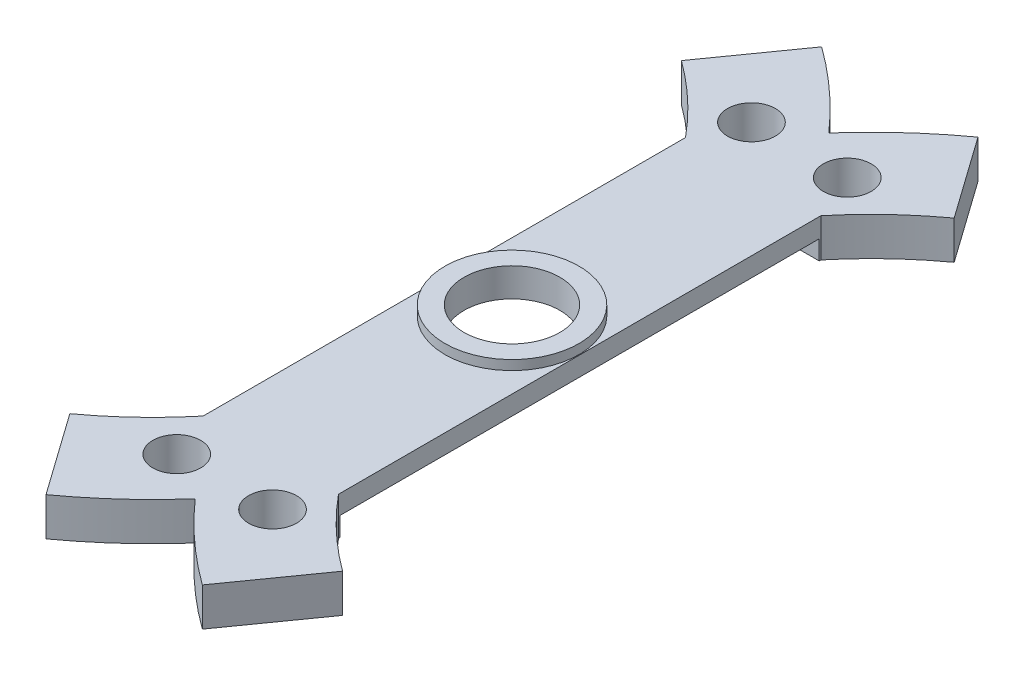
ISO-10303-21;
HEADER;
FILE_DESCRIPTION(('STEP AP214'),'2;1');
FILE_NAME('part.step','',(''),(''),'','','');
FILE_SCHEMA(('AUTOMOTIVE_DESIGN { 1 0 10303 214 1 1 1 1 }'));
ENDSEC;
DATA;
#1=APPLICATION_CONTEXT('core data for automotive mechanical design processes');
#2=APPLICATION_PROTOCOL_DEFINITION('international standard','automotive_design',2000,#1);
#3=PRODUCT_CONTEXT('',#1,'mechanical');
#4=PRODUCT('Part','Part','',(#3));
#5=PRODUCT_RELATED_PRODUCT_CATEGORY('part','',(#4));
#6=PRODUCT_DEFINITION_FORMATION('','',#4);
#7=PRODUCT_DEFINITION_CONTEXT('part definition',#1,'design');
#8=PRODUCT_DEFINITION('design','',#6,#7);
#9=PRODUCT_DEFINITION_SHAPE('','',#8);
#10=(LENGTH_UNIT() NAMED_UNIT(*) SI_UNIT(.MILLI.,.METRE.));
#11=(NAMED_UNIT(*) PLANE_ANGLE_UNIT() SI_UNIT($,.RADIAN.));
#12=(NAMED_UNIT(*) SI_UNIT($,.STERADIAN.) SOLID_ANGLE_UNIT());
#13=UNCERTAINTY_MEASURE_WITH_UNIT(LENGTH_MEASURE(1.E-05),#10,'distance_accuracy_value','');
#14=(GEOMETRIC_REPRESENTATION_CONTEXT(3) GLOBAL_UNCERTAINTY_ASSIGNED_CONTEXT((#13)) GLOBAL_UNIT_ASSIGNED_CONTEXT((#10,
#11,#12)) REPRESENTATION_CONTEXT('',''));
#15=CARTESIAN_POINT('',(0.,0.,0.));
#16=DIRECTION('',(0.,0.,1.));
#17=DIRECTION('',(1.,0.,0.));
#18=AXIS2_PLACEMENT_3D('',#15,#16,#17);
#19=CARTESIAN_POINT('',(0.,4.,0.));
#20=DIRECTION('',(0.,1.,0.));
#21=DIRECTION('',(0.,0.,1.));
#22=AXIS2_PLACEMENT_3D('',#19,#20,#21);
#23=PLANE('',#22);
#24=DIRECTION('',(0.,0.,1.));
#25=VECTOR('',#24,1.);
#26=CARTESIAN_POINT('',(9.04150236544862,4.,-34.2073242437727));
#27=LINE('',#26,#25);
#28=CARTESIAN_POINT('',(9.04150236544863,4.,-34.2073242437727));
#29=VERTEX_POINT('',#28);
#30=CARTESIAN_POINT('',(9.04150236544863,4.,16.1540395545125));
#31=VERTEX_POINT('',#30);
#32=EDGE_CURVE('E211',#29,#31,#27,.T.);
#33=ORIENTED_EDGE('',*,*,#32,.T.);
#34=CARTESIAN_POINT('',(-21.3917567287429,4.,-9.02664234463008));
#35=DIRECTION('',(0.,-1.,0.));
#36=DIRECTION('',(0.,0.,1.));
#37=AXIS2_PLACEMENT_3D('',#34,#35,#36);
#38=CIRCLE('',#37,39.5);
#39=CARTESIAN_POINT('',(1.87034849291269,4.,22.8970864578865));
#40=VERTEX_POINT('',#39);
#41=EDGE_CURVE('E182',#31,#40,#38,.T.);
#42=ORIENTED_EDGE('',*,*,#41,.T.);
#43=DIRECTION('',(0.578636548404458,0.,0.815585522707812));
#44=VECTOR('',#43,1.);
#45=CARTESIAN_POINT('',(1.8703484929127,4.,22.8970864578865));
#46=LINE('',#45,#44);
#47=CARTESIAN_POINT('',(7.94641682529626,4.,31.4612765017749));
#48=VERTEX_POINT('',#47);
#49=EDGE_CURVE('E180',#40,#48,#46,.T.);
#50=ORIENTED_EDGE('',*,*,#49,.T.);
#51=CARTESIAN_POINT('',(-21.3917567287429,4.,-9.02664234463008));
#52=DIRECTION('',(0.,1.,0.));
#53=DIRECTION('',(0.,0.,1.));
#54=AXIS2_PLACEMENT_3D('',#51,#52,#53);
#55=CIRCLE('',#54,50.);
#56=CARTESIAN_POINT('',(16.1082432712571,4.,24.0452490436773));
#57=VERTEX_POINT('',#56);
#58=EDGE_CURVE('E49',#48,#57,#55,.T.);
#59=ORIENTED_EDGE('',*,*,#58,.T.);
#60=CARTESIAN_POINT('',(53.6082432712571,4.,-9.02664234463008));
#61=DIRECTION('',(0.,1.,0.));
#62=DIRECTION('',(0.,0.,1.));
#63=AXIS2_PLACEMENT_3D('',#60,#61,#62);
#64=CIRCLE('',#63,50.);
#65=CARTESIAN_POINT('',(24.2700697172182,4.,31.4612765017751));
#66=VERTEX_POINT('',#65);
#67=EDGE_CURVE('E168',#57,#66,#64,.T.);
#68=ORIENTED_EDGE('',*,*,#67,.T.);
#69=DIRECTION('',(0.578636548404452,0.,-0.815585522707817));
#70=VECTOR('',#69,1.);
#71=CARTESIAN_POINT('',(24.2700697172182,4.,31.4612765017751));
#72=LINE('',#71,#70);
#73=CARTESIAN_POINT('',(30.3461380496017,4.,22.8970864578866));
#74=VERTEX_POINT('',#73);
#75=EDGE_CURVE('E174',#66,#74,#72,.T.);
#76=ORIENTED_EDGE('',*,*,#75,.T.);
#77=CARTESIAN_POINT('',(53.6082432712571,4.,-9.02664234463008));
#78=DIRECTION('',(0.,-1.,0.));
#79=DIRECTION('',(0.,0.,1.));
#80=AXIS2_PLACEMENT_3D('',#77,#78,#79);
#81=CIRCLE('',#80,39.5);
#82=CARTESIAN_POINT('',(23.1749841770655,4.,16.1540395545125));
#83=VERTEX_POINT('',#82);
#84=EDGE_CURVE('E187',#74,#83,#81,.T.);
#85=ORIENTED_EDGE('',*,*,#84,.T.);
#86=DIRECTION('',(0.,0.,-1.));
#87=VECTOR('',#86,1.);
#88=CARTESIAN_POINT('',(23.1749841770656,4.,16.1540395545125));
#89=LINE('',#88,#87);
#90=CARTESIAN_POINT('',(23.1749841770656,4.,-34.2073242437727));
#91=VERTEX_POINT('',#90);
#92=EDGE_CURVE('E190',#83,#91,#89,.T.);
#93=ORIENTED_EDGE('',*,*,#92,.T.);
#94=CARTESIAN_POINT('',(53.6082432712571,4.,-9.02664234463008));
#95=DIRECTION('',(0.,-1.,0.));
#96=DIRECTION('',(0.,0.,1.));
#97=AXIS2_PLACEMENT_3D('',#94,#95,#96);
#98=CIRCLE('',#97,39.5);
#99=CARTESIAN_POINT('',(30.3461380496017,4.,-40.9503711471467));
#100=VERTEX_POINT('',#99);
#101=EDGE_CURVE('E193',#91,#100,#98,.T.);
#102=ORIENTED_EDGE('',*,*,#101,.T.);
#103=DIRECTION('',(-0.578636548404452,0.,-0.815585522707816));
#104=VECTOR('',#103,1.);
#105=CARTESIAN_POINT('',(30.3461380496017,4.,-40.9503711471467));
#106=LINE('',#105,#104);
#107=CARTESIAN_POINT('',(24.2700697172181,4.,-49.5145611910353));
#108=VERTEX_POINT('',#107);
#109=EDGE_CURVE('E196',#100,#108,#106,.T.);
#110=ORIENTED_EDGE('',*,*,#109,.T.);
#111=CARTESIAN_POINT('',(53.6082432712571,4.,-9.02664234463008));
#112=DIRECTION('',(0.,1.,0.));
#113=DIRECTION('',(0.,0.,1.));
#114=AXIS2_PLACEMENT_3D('',#111,#112,#113);
#115=CIRCLE('',#114,50.);
#116=CARTESIAN_POINT('',(16.1082432712571,4.,-42.0985337329375));
#117=VERTEX_POINT('',#116);
#118=EDGE_CURVE('E199',#108,#117,#115,.T.);
#119=ORIENTED_EDGE('',*,*,#118,.T.);
#120=CARTESIAN_POINT('',(-21.3917567287429,4.,-9.02664234463008));
#121=DIRECTION('',(0.,1.,0.));
#122=DIRECTION('',(0.,0.,1.));
#123=AXIS2_PLACEMENT_3D('',#120,#121,#122);
#124=CIRCLE('',#123,50.);
#125=CARTESIAN_POINT('',(7.94641682529603,4.,-49.5145611910352));
#126=VERTEX_POINT('',#125);
#127=EDGE_CURVE('E202',#117,#126,#124,.T.);
#128=ORIENTED_EDGE('',*,*,#127,.T.);
#129=DIRECTION('',(-0.578636548404453,0.,0.815585522707815));
#130=VECTOR('',#129,1.);
#131=CARTESIAN_POINT('',(7.94641682529603,4.,-49.5145611910352));
#132=LINE('',#131,#130);
#133=CARTESIAN_POINT('',(1.8703484929125,4.,-40.9503711471468));
#134=VERTEX_POINT('',#133);
#135=EDGE_CURVE('E205',#126,#134,#132,.T.);
#136=ORIENTED_EDGE('',*,*,#135,.T.);
#137=CARTESIAN_POINT('',(-21.3917567287429,4.,-9.02664234463008));
#138=DIRECTION('',(0.,-1.,0.));
#139=DIRECTION('',(0.,0.,1.));
#140=AXIS2_PLACEMENT_3D('',#137,#138,#139);
#141=CIRCLE('',#140,39.5);
#142=EDGE_CURVE('E208',#134,#29,#141,.T.);
#143=ORIENTED_EDGE('',*,*,#142,.T.);
#144=EDGE_LOOP('',(#33,#42,#50,#59,#68,#76,#85,#93,#102,#110,#119,#128,#136,#143));
#145=FACE_BOUND('',#144,.T.);
#146=CARTESIAN_POINT('',(11.1082432712571,4.,20.9733576553699));
#147=DIRECTION('',(0.,1.,0.));
#148=DIRECTION('',(0.,0.,1.));
#149=AXIS2_PLACEMENT_3D('',#146,#147,#148);
#150=CIRCLE('',#149,2.5);
#151=CARTESIAN_POINT('',(11.1082432712571,4.,23.4733576553699));
#152=VERTEX_POINT('',#151);
#153=EDGE_CURVE('E273',#152,#152,#150,.T.);
#154=ORIENTED_EDGE('',*,*,#153,.F.);
#155=EDGE_LOOP('',(#154));
#156=FACE_BOUND('',#155,.T.);
#157=CARTESIAN_POINT('',(21.1082432712571,4.,20.9733576553699));
#158=DIRECTION('',(0.,1.,0.));
#159=DIRECTION('',(0.,0.,1.));
#160=AXIS2_PLACEMENT_3D('',#157,#158,#159);
#161=CIRCLE('',#160,2.5);
#162=CARTESIAN_POINT('',(21.1082432712571,4.,23.4733576553699));
#163=VERTEX_POINT('',#162);
#164=EDGE_CURVE('E284',#163,#163,#161,.T.);
#165=ORIENTED_EDGE('',*,*,#164,.F.);
#166=EDGE_LOOP('',(#165));
#167=FACE_BOUND('',#166,.T.);
#168=CARTESIAN_POINT('',(11.1082432712571,4.,-39.0266423446301));
#169=DIRECTION('',(0.,1.,0.));
#170=DIRECTION('',(0.,0.,1.));
#171=AXIS2_PLACEMENT_3D('',#168,#169,#170);
#172=CIRCLE('',#171,2.5);
#173=CARTESIAN_POINT('',(11.1082432712571,4.,-36.5266423446301));
#174=VERTEX_POINT('',#173);
#175=EDGE_CURVE('E287',#174,#174,#172,.F.);
#176=ORIENTED_EDGE('',*,*,#175,.T.);
#177=EDGE_LOOP('',(#176));
#178=FACE_BOUND('',#177,.T.);
#179=CARTESIAN_POINT('',(21.1082432712571,4.,-39.0266423446301));
#180=DIRECTION('',(0.,1.,0.));
#181=DIRECTION('',(0.,0.,1.));
#182=AXIS2_PLACEMENT_3D('',#179,#180,#181);
#183=CIRCLE('',#182,2.5);
#184=CARTESIAN_POINT('',(21.1082432712571,4.,-36.5266423446301));
#185=VERTEX_POINT('',#184);
#186=EDGE_CURVE('E290',#185,#185,#183,.F.);
#187=ORIENTED_EDGE('',*,*,#186,.T.);
#188=EDGE_LOOP('',(#187));
#189=FACE_BOUND('',#188,.T.);
#190=CARTESIAN_POINT('',(16.1082432712571,4.,-9.02471139520564));
#191=DIRECTION('',(0.,1.,0.));
#192=DIRECTION('',(0.,0.,1.));
#193=AXIS2_PLACEMENT_3D('',#190,#191,#192);
#194=CIRCLE('',#193,7.);
#195=CARTESIAN_POINT('',(16.1082432712571,4.,-2.02471139520564));
#196=VERTEX_POINT('',#195);
#197=EDGE_CURVE('E328',#196,#196,#194,.T.);
#198=ORIENTED_EDGE('',*,*,#197,.F.);
#199=EDGE_LOOP('',(#198));
#200=FACE_BOUND('',#199,.T.);
#201=ADVANCED_FACE('F34',(#145,#156,#167,#178,#189,#200),#23,.T.);
#202=CARTESIAN_POINT('',(0.,2.,-34.0266423446301));
#203=DIRECTION('',(0.,0.,-1.));
#204=DIRECTION('',(-1.,0.,0.));
#205=AXIS2_PLACEMENT_3D('',#202,#203,#204);
#206=PLANE('',#205);
#207=DIRECTION('',(0.,1.,0.));
#208=VECTOR('',#207,1.);
#209=CARTESIAN_POINT('',(9.04150236544862,2.,-34.0266423446301));
#210=LINE('',#209,#208);
#211=CARTESIAN_POINT('',(9.04150236544862,0.,-34.0266423446301));
#212=VERTEX_POINT('',#211);
#213=CARTESIAN_POINT('',(9.04150236544862,2.,-34.0266423446301));
#214=VERTEX_POINT('',#213);
#215=EDGE_CURVE('E250',#212,#214,#210,.T.);
#216=ORIENTED_EDGE('',*,*,#215,.F.);
#217=DIRECTION('',(1.,0.,0.));
#218=VECTOR('',#217,1.);
#219=CARTESIAN_POINT('',(0.,0.,-34.0266423446301));
#220=LINE('',#219,#218);
#221=CARTESIAN_POINT('',(23.1749841770656,0.,-34.0266423446301));
#222=VERTEX_POINT('',#221);
#223=EDGE_CURVE('E301',#212,#222,#220,.T.);
#224=ORIENTED_EDGE('',*,*,#223,.T.);
#225=DIRECTION('',(0.,-1.,0.));
#226=VECTOR('',#225,1.);
#227=CARTESIAN_POINT('',(23.1749841770656,2.,-34.0266423446301));
#228=LINE('',#227,#226);
#229=CARTESIAN_POINT('',(23.1749841770656,2.,-34.0266423446301));
#230=VERTEX_POINT('',#229);
#231=EDGE_CURVE('E241',#230,#222,#228,.T.);
#232=ORIENTED_EDGE('',*,*,#231,.F.);
#233=DIRECTION('',(1.,0.,0.));
#234=VECTOR('',#233,1.);
#235=CARTESIAN_POINT('',(0.,2.,-34.0266423446301));
#236=LINE('',#235,#234);
#237=EDGE_CURVE('E294',#214,#230,#236,.T.);
#238=ORIENTED_EDGE('',*,*,#237,.F.);
#239=EDGE_LOOP('',(#216,#224,#232,#238));
#240=FACE_BOUND('',#239,.T.);
#241=ADVANCED_FACE('F352',(#240),#206,.F.);
#242=CARTESIAN_POINT('',(0.,0.,0.));
#243=DIRECTION('',(0.,1.,0.));
#244=DIRECTION('',(0.,0.,1.));
#245=AXIS2_PLACEMENT_3D('',#242,#243,#244);
#246=PLANE('',#245);
#247=CARTESIAN_POINT('',(11.1082432712571,0.,-39.0266423446301));
#248=DIRECTION('',(0.,1.,0.));
#249=DIRECTION('',(0.,0.,1.));
#250=AXIS2_PLACEMENT_3D('',#247,#248,#249);
#251=CIRCLE('',#250,2.5);
#252=CARTESIAN_POINT('',(11.1082432712571,0.,-36.5266423446301));
#253=VERTEX_POINT('',#252);
#254=EDGE_CURVE('E298',#253,#253,#251,.F.);
#255=ORIENTED_EDGE('',*,*,#254,.F.);
#256=EDGE_LOOP('',(#255));
#257=FACE_BOUND('',#256,.T.);
#258=CARTESIAN_POINT('',(21.1082432712571,0.,-39.0266423446301));
#259=DIRECTION('',(0.,1.,0.));
#260=DIRECTION('',(0.,0.,1.));
#261=AXIS2_PLACEMENT_3D('',#258,#259,#260);
#262=CIRCLE('',#261,2.5);
#263=CARTESIAN_POINT('',(21.1082432712571,0.,-36.5266423446301));
#264=VERTEX_POINT('',#263);
#265=EDGE_CURVE('E293',#264,#264,#262,.F.);
#266=ORIENTED_EDGE('',*,*,#265,.F.);
#267=EDGE_LOOP('',(#266));
#268=FACE_BOUND('',#267,.T.);
#269=DIRECTION('',(0.,0.,1.));
#270=VECTOR('',#269,1.);
#271=CARTESIAN_POINT('',(9.04150236544863,0.,0.));
#272=LINE('',#271,#270);
#273=CARTESIAN_POINT('',(9.04150236544863,0.,-34.2073242437727));
#274=VERTEX_POINT('',#273);
#275=EDGE_CURVE('E252',#274,#212,#272,.T.);
#276=ORIENTED_EDGE('',*,*,#275,.F.);
#277=CARTESIAN_POINT('',(-21.3917567287429,0.,-9.02664234463008));
#278=DIRECTION('',(0.,1.,0.));
#279=DIRECTION('',(0.,0.,1.));
#280=AXIS2_PLACEMENT_3D('',#277,#278,#279);
#281=CIRCLE('',#280,39.5);
#282=CARTESIAN_POINT('',(1.8703484929125,0.,-40.9503711471468));
#283=VERTEX_POINT('',#282);
#284=EDGE_CURVE('E264',#283,#274,#281,.F.);
#285=ORIENTED_EDGE('',*,*,#284,.F.);
#286=DIRECTION('',(-0.578636548404453,0.,0.815585522707815));
#287=VECTOR('',#286,1.);
#288=CARTESIAN_POINT('',(-18.0814921050125,0.,-12.828344655886));
#289=LINE('',#288,#287);
#290=CARTESIAN_POINT('',(7.94641682529603,0.,-49.5145611910352));
#291=VERTEX_POINT('',#290);
#292=EDGE_CURVE('E262',#291,#283,#289,.T.);
#293=ORIENTED_EDGE('',*,*,#292,.F.);
#294=CARTESIAN_POINT('',(-21.3917567287429,0.,-9.02664234463008));
#295=DIRECTION('',(0.,1.,0.));
#296=DIRECTION('',(0.,0.,1.));
#297=AXIS2_PLACEMENT_3D('',#294,#295,#296);
#298=CIRCLE('',#297,50.);
#299=CARTESIAN_POINT('',(16.1082432712571,0.,-42.0985337329375));
#300=VERTEX_POINT('',#299);
#301=EDGE_CURVE('E260',#300,#291,#298,.T.);
#302=ORIENTED_EDGE('',*,*,#301,.F.);
#303=CARTESIAN_POINT('',(53.6082432712571,0.,-9.02664234463008));
#304=DIRECTION('',(0.,1.,0.));
#305=DIRECTION('',(0.,0.,1.));
#306=AXIS2_PLACEMENT_3D('',#303,#304,#305);
#307=CIRCLE('',#306,50.);
#308=CARTESIAN_POINT('',(24.2700697172181,0.,-49.5145611910353));
#309=VERTEX_POINT('',#308);
#310=EDGE_CURVE('E258',#309,#300,#307,.T.);
#311=ORIENTED_EDGE('',*,*,#310,.F.);
#312=DIRECTION('',(-0.578636548404452,0.,-0.815585522707816));
#313=VECTOR('',#312,1.);
#314=CARTESIAN_POINT('',(39.5112464033443,0.,-28.0321935657746));
#315=LINE('',#314,#313);
#316=CARTESIAN_POINT('',(30.3461380496017,0.,-40.9503711471467));
#317=VERTEX_POINT('',#316);
#318=EDGE_CURVE('E256',#317,#309,#315,.T.);
#319=ORIENTED_EDGE('',*,*,#318,.F.);
#320=CARTESIAN_POINT('',(53.6082432712571,0.,-9.02664234463008));
#321=DIRECTION('',(0.,1.,0.));
#322=DIRECTION('',(0.,0.,1.));
#323=AXIS2_PLACEMENT_3D('',#320,#321,#322);
#324=CIRCLE('',#323,39.5);
#325=CARTESIAN_POINT('',(23.1749841770656,0.,-34.2073242437727));
#326=VERTEX_POINT('',#325);
#327=EDGE_CURVE('E254',#326,#317,#324,.F.);
#328=ORIENTED_EDGE('',*,*,#327,.F.);
#329=DIRECTION('',(0.,0.,-1.));
#330=VECTOR('',#329,1.);
#331=CARTESIAN_POINT('',(23.1749841770656,0.,0.));
#332=LINE('',#331,#330);
#333=EDGE_CURVE('E243',#222,#326,#332,.T.);
#334=ORIENTED_EDGE('',*,*,#333,.F.);
#335=ORIENTED_EDGE('',*,*,#223,.F.);
#336=EDGE_LOOP('',(#276,#285,#293,#302,#311,#319,#328,#334,#335));
#337=FACE_BOUND('',#336,.T.);
#338=ADVANCED_FACE('F357',(#257,#268,#337),#246,.F.);
#339=CARTESIAN_POINT('',(0.,2.,0.));
#340=DIRECTION('',(0.,1.,0.));
#341=DIRECTION('',(0.,0.,1.));
#342=AXIS2_PLACEMENT_3D('',#339,#340,#341);
#343=PLANE('',#342);
#344=CARTESIAN_POINT('',(16.1082432712571,2.,-9.02471139520564));
#345=DIRECTION('',(0.,1.,0.));
#346=DIRECTION('',(0.,0.,1.));
#347=AXIS2_PLACEMENT_3D('',#344,#345,#346);
#348=CIRCLE('',#347,5.);
#349=CARTESIAN_POINT('',(16.1082432712571,2.,-4.02471139520564));
#350=VERTEX_POINT('',#349);
#351=EDGE_CURVE('E266',#350,#350,#348,.T.);
#352=ORIENTED_EDGE('',*,*,#351,.T.);
#353=EDGE_LOOP('',(#352));
#354=FACE_BOUND('',#353,.T.);
#355=DIRECTION('',(0.,0.,1.));
#356=VECTOR('',#355,1.);
#357=CARTESIAN_POINT('',(9.04150236544863,2.,0.));
#358=LINE('',#357,#356);
#359=CARTESIAN_POINT('',(9.04150236544863,2.,15.9733576553699));
#360=VERTEX_POINT('',#359);
#361=EDGE_CURVE('E248',#214,#360,#358,.T.);
#362=ORIENTED_EDGE('',*,*,#361,.F.);
#363=ORIENTED_EDGE('',*,*,#237,.T.);
#364=DIRECTION('',(0.,0.,-1.));
#365=VECTOR('',#364,1.);
#366=CARTESIAN_POINT('',(23.1749841770656,2.,0.));
#367=LINE('',#366,#365);
#368=CARTESIAN_POINT('',(23.1749841770656,2.,15.9733576553699));
#369=VERTEX_POINT('',#368);
#370=EDGE_CURVE('E239',#369,#230,#367,.T.);
#371=ORIENTED_EDGE('',*,*,#370,.F.);
#372=DIRECTION('',(1.,0.,0.));
#373=VECTOR('',#372,1.);
#374=CARTESIAN_POINT('',(0.,2.,15.9733576553699));
#375=LINE('',#374,#373);
#376=EDGE_CURVE('E270',#360,#369,#375,.T.);
#377=ORIENTED_EDGE('',*,*,#376,.F.);
#378=EDGE_LOOP('',(#362,#363,#371,#377));
#379=FACE_BOUND('',#378,.T.);
#380=ADVANCED_FACE('F363',(#354,#379),#343,.F.);
#381=CARTESIAN_POINT('',(0.,2.,15.9733576553699));
#382=DIRECTION('',(0.,0.,-1.));
#383=DIRECTION('',(-1.,0.,0.));
#384=AXIS2_PLACEMENT_3D('',#381,#382,#383);
#385=PLANE('',#384);
#386=DIRECTION('',(1.,0.,0.));
#387=VECTOR('',#386,1.);
#388=CARTESIAN_POINT('',(0.,0.,15.9733576553699));
#389=LINE('',#388,#387);
#390=CARTESIAN_POINT('',(9.04150236544863,0.,15.9733576553699));
#391=VERTEX_POINT('',#390);
#392=CARTESIAN_POINT('',(23.1749841770656,0.,15.9733576553699));
#393=VERTEX_POINT('',#392);
#394=EDGE_CURVE('E269',#391,#393,#389,.T.);
#395=ORIENTED_EDGE('',*,*,#394,.F.);
#396=DIRECTION('',(0.,1.,0.));
#397=VECTOR('',#396,1.);
#398=CARTESIAN_POINT('',(9.04150236544863,2.,15.9733576553699));
#399=LINE('',#398,#397);
#400=EDGE_CURVE('E245',#391,#360,#399,.T.);
#401=ORIENTED_EDGE('',*,*,#400,.T.);
#402=ORIENTED_EDGE('',*,*,#376,.T.);
#403=DIRECTION('',(0.,-1.,0.));
#404=VECTOR('',#403,1.);
#405=CARTESIAN_POINT('',(23.1749841770656,2.,15.9733576553699));
#406=LINE('',#405,#404);
#407=EDGE_CURVE('E215',#369,#393,#406,.T.);
#408=ORIENTED_EDGE('',*,*,#407,.T.);
#409=EDGE_LOOP('',(#395,#401,#402,#408));
#410=FACE_BOUND('',#409,.T.);
#411=ADVANCED_FACE('F361',(#410),#385,.T.);
#412=CARTESIAN_POINT('',(0.,0.,0.));
#413=DIRECTION('',(0.,1.,0.));
#414=DIRECTION('',(0.,0.,1.));
#415=AXIS2_PLACEMENT_3D('',#412,#413,#414);
#416=PLANE('',#415);
#417=CARTESIAN_POINT('',(11.1082432712571,0.,20.9733576553699));
#418=DIRECTION('',(0.,1.,0.));
#419=DIRECTION('',(0.,0.,1.));
#420=AXIS2_PLACEMENT_3D('',#417,#418,#419);
#421=CIRCLE('',#420,2.5);
#422=CARTESIAN_POINT('',(11.1082432712571,0.,23.4733576553699));
#423=VERTEX_POINT('',#422);
#424=EDGE_CURVE('E274',#423,#423,#421,.T.);
#425=ORIENTED_EDGE('',*,*,#424,.T.);
#426=EDGE_LOOP('',(#425));
#427=FACE_BOUND('',#426,.T.);
#428=CARTESIAN_POINT('',(21.1082432712571,0.,20.9733576553699));
#429=DIRECTION('',(0.,1.,0.));
#430=DIRECTION('',(0.,0.,1.));
#431=AXIS2_PLACEMENT_3D('',#428,#429,#430);
#432=CIRCLE('',#431,2.5);
#433=CARTESIAN_POINT('',(21.1082432712571,0.,23.4733576553699));
#434=VERTEX_POINT('',#433);
#435=EDGE_CURVE('E277',#434,#434,#432,.T.);
#436=ORIENTED_EDGE('',*,*,#435,.T.);
#437=EDGE_LOOP('',(#436));
#438=FACE_BOUND('',#437,.T.);
#439=DIRECTION('',(0.,0.,1.));
#440=VECTOR('',#439,1.);
#441=CARTESIAN_POINT('',(9.04150236544863,0.,0.));
#442=LINE('',#441,#440);
#443=CARTESIAN_POINT('',(9.04150236544863,0.,16.1540395545125));
#444=VERTEX_POINT('',#443);
#445=EDGE_CURVE('E11',#391,#444,#442,.T.);
#446=ORIENTED_EDGE('',*,*,#445,.F.);
#447=ORIENTED_EDGE('',*,*,#394,.T.);
#448=DIRECTION('',(0.,0.,-1.));
#449=VECTOR('',#448,1.);
#450=CARTESIAN_POINT('',(23.1749841770656,0.,0.));
#451=LINE('',#450,#449);
#452=CARTESIAN_POINT('',(23.1749841770655,0.,16.1540395545125));
#453=VERTEX_POINT('',#452);
#454=EDGE_CURVE('E314',#453,#393,#451,.T.);
#455=ORIENTED_EDGE('',*,*,#454,.F.);
#456=CARTESIAN_POINT('',(53.6082432712571,0.,-9.02664234463008));
#457=DIRECTION('',(0.,1.,0.));
#458=DIRECTION('',(0.,0.,1.));
#459=AXIS2_PLACEMENT_3D('',#456,#457,#458);
#460=CIRCLE('',#459,39.5);
#461=CARTESIAN_POINT('',(30.3461380496017,0.,22.8970864578866));
#462=VERTEX_POINT('',#461);
#463=EDGE_CURVE('E312',#462,#453,#460,.F.);
#464=ORIENTED_EDGE('',*,*,#463,.F.);
#465=DIRECTION('',(0.578636548404452,0.,-0.815585522707817));
#466=VECTOR('',#465,1.);
#467=CARTESIAN_POINT('',(30.9914032360734,0.,21.9875881798315));
#468=LINE('',#467,#466);
#469=CARTESIAN_POINT('',(24.2700697172182,0.,31.4612765017751));
#470=VERTEX_POINT('',#469);
#471=EDGE_CURVE('E310',#470,#462,#468,.T.);
#472=ORIENTED_EDGE('',*,*,#471,.F.);
#473=CARTESIAN_POINT('',(53.6082432712571,0.,-9.02664234463008));
#474=DIRECTION('',(0.,1.,0.));
#475=DIRECTION('',(0.,0.,1.));
#476=AXIS2_PLACEMENT_3D('',#473,#474,#475);
#477=CIRCLE('',#476,50.);
#478=CARTESIAN_POINT('',(16.1082432712571,0.,24.0452490436773));
#479=VERTEX_POINT('',#478);
#480=EDGE_CURVE('E308',#479,#470,#477,.T.);
#481=ORIENTED_EDGE('',*,*,#480,.F.);
#482=CARTESIAN_POINT('',(-21.3917567287429,0.,-9.02664234463008));
#483=DIRECTION('',(0.,1.,0.));
#484=DIRECTION('',(0.,0.,1.));
#485=AXIS2_PLACEMENT_3D('',#482,#483,#484);
#486=CIRCLE('',#485,50.);
#487=CARTESIAN_POINT('',(7.94641682529626,0.,31.4612765017749));
#488=VERTEX_POINT('',#487);
#489=EDGE_CURVE('E161',#488,#479,#486,.T.);
#490=ORIENTED_EDGE('',*,*,#489,.F.);
#491=DIRECTION('',(0.578636548404458,0.,0.815585522707813));
#492=VECTOR('',#491,1.);
#493=CARTESIAN_POINT('',(-9.56164893774139,0.,6.78373926994282));
#494=LINE('',#493,#492);
#495=CARTESIAN_POINT('',(1.8703484929127,0.,22.8970864578865));
#496=VERTEX_POINT('',#495);
#497=EDGE_CURVE('E297',#496,#488,#494,.T.);
#498=ORIENTED_EDGE('',*,*,#497,.F.);
#499=CARTESIAN_POINT('',(-21.3917567287429,0.,-9.02664234463008));
#500=DIRECTION('',(0.,1.,0.));
#501=DIRECTION('',(0.,0.,1.));
#502=AXIS2_PLACEMENT_3D('',#499,#500,#501);
#503=CIRCLE('',#502,39.5);
#504=EDGE_CURVE('E42',#444,#496,#503,.F.);
#505=ORIENTED_EDGE('',*,*,#504,.F.);
#506=EDGE_LOOP('',(#446,#447,#455,#464,#472,#481,#490,#498,#505));
#507=FACE_BOUND('',#506,.T.);
#508=ADVANCED_FACE('F323',(#427,#438,#507),#416,.F.);
#509=CARTESIAN_POINT('',(21.1082432712571,2.,-39.0266423446301));
#510=DIRECTION('',(0.,-1.,0.));
#511=DIRECTION('',(0.,0.,-1.));
#512=AXIS2_PLACEMENT_3D('',#509,#510,#511);
#513=CYLINDRICAL_SURFACE('',#512,2.5);
#514=ORIENTED_EDGE('',*,*,#265,.T.);
#515=EDGE_LOOP('',(#514));
#516=FACE_BOUND('',#515,.T.);
#517=ORIENTED_EDGE('',*,*,#186,.F.);
#518=EDGE_LOOP('',(#517));
#519=FACE_BOUND('',#518,.T.);
#520=ADVANCED_FACE('F36',(#516,#519),#513,.F.);
#521=CARTESIAN_POINT('',(11.1082432712571,2.,-39.0266423446301));
#522=DIRECTION('',(0.,-1.,0.));
#523=DIRECTION('',(0.,0.,-1.));
#524=AXIS2_PLACEMENT_3D('',#521,#522,#523);
#525=CYLINDRICAL_SURFACE('',#524,2.5);
#526=ORIENTED_EDGE('',*,*,#254,.T.);
#527=EDGE_LOOP('',(#526));
#528=FACE_BOUND('',#527,.T.);
#529=ORIENTED_EDGE('',*,*,#175,.F.);
#530=EDGE_LOOP('',(#529));
#531=FACE_BOUND('',#530,.T.);
#532=ADVANCED_FACE('F371',(#528,#531),#525,.F.);
#533=CARTESIAN_POINT('',(21.1082432712571,4.,20.9733576553699));
#534=DIRECTION('',(0.,-1.,0.));
#535=DIRECTION('',(0.,0.,-1.));
#536=AXIS2_PLACEMENT_3D('',#533,#534,#535);
#537=CYLINDRICAL_SURFACE('',#536,2.5);
#538=ORIENTED_EDGE('',*,*,#164,.T.);
#539=EDGE_LOOP('',(#538));
#540=FACE_BOUND('',#539,.T.);
#541=ORIENTED_EDGE('',*,*,#435,.F.);
#542=EDGE_LOOP('',(#541));
#543=FACE_BOUND('',#542,.T.);
#544=ADVANCED_FACE('F367',(#540,#543),#537,.F.);
#545=CARTESIAN_POINT('',(11.1082432712571,4.,20.9733576553699));
#546=DIRECTION('',(0.,-1.,0.));
#547=DIRECTION('',(0.,0.,-1.));
#548=AXIS2_PLACEMENT_3D('',#545,#546,#547);
#549=CYLINDRICAL_SURFACE('',#548,2.5);
#550=ORIENTED_EDGE('',*,*,#153,.T.);
#551=EDGE_LOOP('',(#550));
#552=FACE_BOUND('',#551,.T.);
#553=ORIENTED_EDGE('',*,*,#424,.F.);
#554=EDGE_LOOP('',(#553));
#555=FACE_BOUND('',#554,.T.);
#556=ADVANCED_FACE('F370',(#552,#555),#549,.F.);
#557=CARTESIAN_POINT('',(16.1082432712571,0.,-9.02471139520564));
#558=DIRECTION('',(0.,1.,0.));
#559=DIRECTION('',(0.,0.,1.));
#560=AXIS2_PLACEMENT_3D('',#557,#558,#559);
#561=CYLINDRICAL_SURFACE('',#560,5.);
#562=ORIENTED_EDGE('',*,*,#351,.F.);
#563=EDGE_LOOP('',(#562));
#564=FACE_BOUND('',#563,.T.);
#565=CARTESIAN_POINT('',(16.1082432712571,5.,-9.02471139520564));
#566=DIRECTION('',(0.,1.,0.));
#567=DIRECTION('',(0.,0.,1.));
#568=AXIS2_PLACEMENT_3D('',#565,#566,#567);
#569=CIRCLE('',#568,5.);
#570=CARTESIAN_POINT('',(16.1082432712571,5.,-4.02471139520564));
#571=VERTEX_POINT('',#570);
#572=EDGE_CURVE('E332',#571,#571,#569,.T.);
#573=ORIENTED_EDGE('',*,*,#572,.T.);
#574=EDGE_LOOP('',(#573));
#575=FACE_BOUND('',#574,.T.);
#576=ADVANCED_FACE('F337',(#564,#575),#561,.F.);
#577=CARTESIAN_POINT('',(-21.3917567287429,-6.,-9.02664234463008));
#578=DIRECTION('',(0.,1.,0.));
#579=DIRECTION('',(0.,0.,1.));
#580=AXIS2_PLACEMENT_3D('',#577,#578,#579);
#581=CYLINDRICAL_SURFACE('',#580,39.5);
#582=ORIENTED_EDGE('',*,*,#284,.T.);
#583=DIRECTION('',(0.,1.,0.));
#584=VECTOR('',#583,1.);
#585=CARTESIAN_POINT('',(9.04150236544863,-6.,-34.2073242437727));
#586=LINE('',#585,#584);
#587=EDGE_CURVE('E216',#274,#29,#586,.T.);
#588=ORIENTED_EDGE('',*,*,#587,.T.);
#589=ORIENTED_EDGE('',*,*,#142,.F.);
#590=DIRECTION('',(0.,1.,0.));
#591=VECTOR('',#590,1.);
#592=CARTESIAN_POINT('',(1.8703484929125,-6.,-40.9503711471468));
#593=LINE('',#592,#591);
#594=EDGE_CURVE('E218',#283,#134,#593,.T.);
#595=ORIENTED_EDGE('',*,*,#594,.F.);
#596=EDGE_LOOP('',(#582,#588,#589,#595));
#597=FACE_BOUND('',#596,.T.);
#598=ADVANCED_FACE('F421',(#597),#581,.F.);
#599=CARTESIAN_POINT('',(7.94641682529603,-6.,-49.5145611910352));
#600=DIRECTION('',(-0.815585522707815,0.,-0.578636548404453));
#601=DIRECTION('',(-0.578636548404453,0.,0.815585522707815));
#602=AXIS2_PLACEMENT_3D('',#599,#600,#601);
#603=PLANE('',#602);
#604=ORIENTED_EDGE('',*,*,#292,.T.);
#605=ORIENTED_EDGE('',*,*,#594,.T.);
#606=ORIENTED_EDGE('',*,*,#135,.F.);
#607=DIRECTION('',(0.,1.,0.));
#608=VECTOR('',#607,1.);
#609=CARTESIAN_POINT('',(7.94641682529603,-6.,-49.5145611910352));
#610=LINE('',#609,#608);
#611=EDGE_CURVE('E220',#291,#126,#610,.T.);
#612=ORIENTED_EDGE('',*,*,#611,.F.);
#613=EDGE_LOOP('',(#604,#605,#606,#612));
#614=FACE_BOUND('',#613,.T.);
#615=ADVANCED_FACE('F423',(#614),#603,.T.);
#616=CARTESIAN_POINT('',(-21.3917567287429,-6.,-9.02664234463008));
#617=DIRECTION('',(0.,1.,0.));
#618=DIRECTION('',(0.,0.,1.));
#619=AXIS2_PLACEMENT_3D('',#616,#617,#618);
#620=CYLINDRICAL_SURFACE('',#619,50.);
#621=ORIENTED_EDGE('',*,*,#301,.T.);
#622=ORIENTED_EDGE('',*,*,#611,.T.);
#623=ORIENTED_EDGE('',*,*,#127,.F.);
#624=DIRECTION('',(0.,1.,0.));
#625=VECTOR('',#624,1.);
#626=CARTESIAN_POINT('',(16.1082432712571,-6.,-42.0985337329375));
#627=LINE('',#626,#625);
#628=EDGE_CURVE('E222',#300,#117,#627,.T.);
#629=ORIENTED_EDGE('',*,*,#628,.F.);
#630=EDGE_LOOP('',(#621,#622,#623,#629));
#631=FACE_BOUND('',#630,.T.);
#632=ADVANCED_FACE('F430',(#631),#620,.T.);
#633=CARTESIAN_POINT('',(53.6082432712571,-6.,-9.02664234463008));
#634=DIRECTION('',(0.,1.,0.));
#635=DIRECTION('',(0.,0.,1.));
#636=AXIS2_PLACEMENT_3D('',#633,#634,#635);
#637=CYLINDRICAL_SURFACE('',#636,50.);
#638=ORIENTED_EDGE('',*,*,#310,.T.);
#639=ORIENTED_EDGE('',*,*,#628,.T.);
#640=ORIENTED_EDGE('',*,*,#118,.F.);
#641=DIRECTION('',(0.,1.,0.));
#642=VECTOR('',#641,1.);
#643=CARTESIAN_POINT('',(24.2700697172181,-6.,-49.5145611910353));
#644=LINE('',#643,#642);
#645=EDGE_CURVE('E224',#309,#108,#644,.T.);
#646=ORIENTED_EDGE('',*,*,#645,.F.);
#647=EDGE_LOOP('',(#638,#639,#640,#646));
#648=FACE_BOUND('',#647,.T.);
#649=ADVANCED_FACE('F434',(#648),#637,.T.);
#650=CARTESIAN_POINT('',(30.3461380496017,-6.,-40.9503711471467));
#651=DIRECTION('',(0.815585522707816,0.,-0.578636548404452));
#652=DIRECTION('',(-0.578636548404452,0.,-0.815585522707816));
#653=AXIS2_PLACEMENT_3D('',#650,#651,#652);
#654=PLANE('',#653);
#655=ORIENTED_EDGE('',*,*,#318,.T.);
#656=ORIENTED_EDGE('',*,*,#645,.T.);
#657=ORIENTED_EDGE('',*,*,#109,.F.);
#658=DIRECTION('',(0.,1.,0.));
#659=VECTOR('',#658,1.);
#660=CARTESIAN_POINT('',(30.3461380496017,-6.,-40.9503711471467));
#661=LINE('',#660,#659);
#662=EDGE_CURVE('E226',#317,#100,#661,.T.);
#663=ORIENTED_EDGE('',*,*,#662,.F.);
#664=EDGE_LOOP('',(#655,#656,#657,#663));
#665=FACE_BOUND('',#664,.T.);
#666=ADVANCED_FACE('F438',(#665),#654,.T.);
#667=CARTESIAN_POINT('',(53.6082432712571,-6.,-9.02664234463008));
#668=DIRECTION('',(0.,1.,0.));
#669=DIRECTION('',(0.,0.,1.));
#670=AXIS2_PLACEMENT_3D('',#667,#668,#669);
#671=CYLINDRICAL_SURFACE('',#670,39.5);
#672=ORIENTED_EDGE('',*,*,#327,.T.);
#673=ORIENTED_EDGE('',*,*,#662,.T.);
#674=ORIENTED_EDGE('',*,*,#101,.F.);
#675=DIRECTION('',(0.,1.,0.));
#676=VECTOR('',#675,1.);
#677=CARTESIAN_POINT('',(23.1749841770656,-6.,-34.2073242437727));
#678=LINE('',#677,#676);
#679=EDGE_CURVE('E228',#326,#91,#678,.T.);
#680=ORIENTED_EDGE('',*,*,#679,.F.);
#681=EDGE_LOOP('',(#672,#673,#674,#680));
#682=FACE_BOUND('',#681,.T.);
#683=ADVANCED_FACE('F443',(#682),#671,.F.);
#684=CARTESIAN_POINT('',(-21.3917567287429,-6.,-9.02664234463008));
#685=DIRECTION('',(0.,1.,0.));
#686=DIRECTION('',(0.,0.,1.));
#687=AXIS2_PLACEMENT_3D('',#684,#685,#686);
#688=CYLINDRICAL_SURFACE('',#687,39.5);
#689=ORIENTED_EDGE('',*,*,#504,.T.);
#690=DIRECTION('',(0.,1.,0.));
#691=VECTOR('',#690,1.);
#692=CARTESIAN_POINT('',(1.8703484929127,-6.,22.8970864578865));
#693=LINE('',#692,#691);
#694=EDGE_CURVE('E57',#496,#40,#693,.T.);
#695=ORIENTED_EDGE('',*,*,#694,.T.);
#696=ORIENTED_EDGE('',*,*,#41,.F.);
#697=DIRECTION('',(0.,1.,0.));
#698=VECTOR('',#697,1.);
#699=CARTESIAN_POINT('',(9.04150236544863,-6.,16.1540395545125));
#700=LINE('',#699,#698);
#701=EDGE_CURVE('E213',#444,#31,#700,.T.);
#702=ORIENTED_EDGE('',*,*,#701,.F.);
#703=EDGE_LOOP('',(#689,#695,#696,#702));
#704=FACE_BOUND('',#703,.T.);
#705=ADVANCED_FACE('F319',(#704),#688,.F.);
#706=CARTESIAN_POINT('',(9.04150236544862,-6.,-34.2073242437727));
#707=DIRECTION('',(-1.,0.,0.));
#708=DIRECTION('',(0.,0.,1.));
#709=AXIS2_PLACEMENT_3D('',#706,#707,#708);
#710=PLANE('',#709);
#711=ORIENTED_EDGE('',*,*,#275,.T.);
#712=ORIENTED_EDGE('',*,*,#215,.T.);
#713=ORIENTED_EDGE('',*,*,#361,.T.);
#714=ORIENTED_EDGE('',*,*,#400,.F.);
#715=ORIENTED_EDGE('',*,*,#445,.T.);
#716=ORIENTED_EDGE('',*,*,#701,.T.);
#717=ORIENTED_EDGE('',*,*,#32,.F.);
#718=ORIENTED_EDGE('',*,*,#587,.F.);
#719=EDGE_LOOP('',(#711,#712,#713,#714,#715,#716,#717,#718));
#720=FACE_BOUND('',#719,.T.);
#721=ADVANCED_FACE('F406',(#720),#710,.T.);
#722=CARTESIAN_POINT('',(23.1749841770656,-6.,16.1540395545125));
#723=DIRECTION('',(1.,0.,0.));
#724=DIRECTION('',(0.,0.,-1.));
#725=AXIS2_PLACEMENT_3D('',#722,#723,#724);
#726=PLANE('',#725);
#727=ORIENTED_EDGE('',*,*,#333,.T.);
#728=ORIENTED_EDGE('',*,*,#679,.T.);
#729=ORIENTED_EDGE('',*,*,#92,.F.);
#730=DIRECTION('',(0.,1.,0.));
#731=VECTOR('',#730,1.);
#732=CARTESIAN_POINT('',(23.1749841770655,-6.,16.1540395545125));
#733=LINE('',#732,#731);
#734=EDGE_CURVE('E230',#453,#83,#733,.T.);
#735=ORIENTED_EDGE('',*,*,#734,.F.);
#736=ORIENTED_EDGE('',*,*,#454,.T.);
#737=ORIENTED_EDGE('',*,*,#407,.F.);
#738=ORIENTED_EDGE('',*,*,#370,.T.);
#739=ORIENTED_EDGE('',*,*,#231,.T.);
#740=EDGE_LOOP('',(#727,#728,#729,#735,#736,#737,#738,#739));
#741=FACE_BOUND('',#740,.T.);
#742=ADVANCED_FACE('F447',(#741),#726,.T.);
#743=CARTESIAN_POINT('',(53.6082432712571,-6.,-9.02664234463008));
#744=DIRECTION('',(0.,1.,0.));
#745=DIRECTION('',(0.,0.,1.));
#746=AXIS2_PLACEMENT_3D('',#743,#744,#745);
#747=CYLINDRICAL_SURFACE('',#746,39.5);
#748=ORIENTED_EDGE('',*,*,#463,.T.);
#749=ORIENTED_EDGE('',*,*,#734,.T.);
#750=ORIENTED_EDGE('',*,*,#84,.F.);
#751=DIRECTION('',(0.,1.,0.));
#752=VECTOR('',#751,1.);
#753=CARTESIAN_POINT('',(30.3461380496017,-6.,22.8970864578866));
#754=LINE('',#753,#752);
#755=EDGE_CURVE('E232',#462,#74,#754,.T.);
#756=ORIENTED_EDGE('',*,*,#755,.F.);
#757=EDGE_LOOP('',(#748,#749,#750,#756));
#758=FACE_BOUND('',#757,.T.);
#759=ADVANCED_FACE('F451',(#758),#747,.F.);
#760=CARTESIAN_POINT('',(24.2700697172182,-6.,31.4612765017751));
#761=DIRECTION('',(0.815585522707817,0.,0.578636548404452));
#762=DIRECTION('',(0.578636548404452,0.,-0.815585522707817));
#763=AXIS2_PLACEMENT_3D('',#760,#761,#762);
#764=PLANE('',#763);
#765=ORIENTED_EDGE('',*,*,#471,.T.);
#766=ORIENTED_EDGE('',*,*,#755,.T.);
#767=ORIENTED_EDGE('',*,*,#75,.F.);
#768=DIRECTION('',(0.,1.,0.));
#769=VECTOR('',#768,1.);
#770=CARTESIAN_POINT('',(24.2700697172182,-6.,31.4612765017751));
#771=LINE('',#770,#769);
#772=EDGE_CURVE('E164',#470,#66,#771,.T.);
#773=ORIENTED_EDGE('',*,*,#772,.F.);
#774=EDGE_LOOP('',(#765,#766,#767,#773));
#775=FACE_BOUND('',#774,.T.);
#776=ADVANCED_FACE('F455',(#775),#764,.T.);
#777=CARTESIAN_POINT('',(53.6082432712571,-6.,-9.02664234463008));
#778=DIRECTION('',(0.,1.,0.));
#779=DIRECTION('',(0.,0.,1.));
#780=AXIS2_PLACEMENT_3D('',#777,#778,#779);
#781=CYLINDRICAL_SURFACE('',#780,50.);
#782=ORIENTED_EDGE('',*,*,#480,.T.);
#783=ORIENTED_EDGE('',*,*,#772,.T.);
#784=ORIENTED_EDGE('',*,*,#67,.F.);
#785=DIRECTION('',(0.,1.,0.));
#786=VECTOR('',#785,1.);
#787=CARTESIAN_POINT('',(16.1082432712571,-6.,24.0452490436773));
#788=LINE('',#787,#786);
#789=EDGE_CURVE('E157',#479,#57,#788,.T.);
#790=ORIENTED_EDGE('',*,*,#789,.F.);
#791=EDGE_LOOP('',(#782,#783,#784,#790));
#792=FACE_BOUND('',#791,.T.);
#793=ADVANCED_FACE('F169',(#792),#781,.T.);
#794=CARTESIAN_POINT('',(-21.3917567287429,-6.,-9.02664234463008));
#795=DIRECTION('',(0.,1.,0.));
#796=DIRECTION('',(0.,0.,1.));
#797=AXIS2_PLACEMENT_3D('',#794,#795,#796);
#798=CYLINDRICAL_SURFACE('',#797,50.);
#799=ORIENTED_EDGE('',*,*,#489,.T.);
#800=ORIENTED_EDGE('',*,*,#789,.T.);
#801=ORIENTED_EDGE('',*,*,#58,.F.);
#802=DIRECTION('',(0.,1.,0.));
#803=VECTOR('',#802,1.);
#804=CARTESIAN_POINT('',(7.94641682529626,-6.,31.4612765017749));
#805=LINE('',#804,#803);
#806=EDGE_CURVE('E165',#488,#48,#805,.T.);
#807=ORIENTED_EDGE('',*,*,#806,.F.);
#808=EDGE_LOOP('',(#799,#800,#801,#807));
#809=FACE_BOUND('',#808,.T.);
#810=ADVANCED_FACE('F159',(#809),#798,.T.);
#811=CARTESIAN_POINT('',(1.8703484929127,-6.,22.8970864578865));
#812=DIRECTION('',(-0.815585522707813,0.,0.578636548404458));
#813=DIRECTION('',(0.578636548404458,0.,0.815585522707813));
#814=AXIS2_PLACEMENT_3D('',#811,#812,#813);
#815=PLANE('',#814);
#816=ORIENTED_EDGE('',*,*,#497,.T.);
#817=ORIENTED_EDGE('',*,*,#806,.T.);
#818=ORIENTED_EDGE('',*,*,#49,.F.);
#819=ORIENTED_EDGE('',*,*,#694,.F.);
#820=EDGE_LOOP('',(#816,#817,#818,#819));
#821=FACE_BOUND('',#820,.T.);
#822=ADVANCED_FACE('F324',(#821),#815,.T.);
#823=CARTESIAN_POINT('',(16.1082432712571,5.,-9.02471139520564));
#824=DIRECTION('',(0.,1.,0.));
#825=DIRECTION('',(0.,0.,1.));
#826=AXIS2_PLACEMENT_3D('',#823,#824,#825);
#827=PLANE('',#826);
#828=CARTESIAN_POINT('',(16.1082432712571,5.,-9.02471139520564));
#829=DIRECTION('',(0.,1.,0.));
#830=DIRECTION('',(0.,0.,1.));
#831=AXIS2_PLACEMENT_3D('',#828,#829,#830);
#832=CIRCLE('',#831,7.);
#833=CARTESIAN_POINT('',(16.1082432712571,5.,-2.02471139520564));
#834=VERTEX_POINT('',#833);
#835=EDGE_CURVE('E326',#834,#834,#832,.T.);
#836=ORIENTED_EDGE('',*,*,#835,.T.);
#837=EDGE_LOOP('',(#836));
#838=FACE_BOUND('',#837,.T.);
#839=ORIENTED_EDGE('',*,*,#572,.F.);
#840=EDGE_LOOP('',(#839));
#841=FACE_BOUND('',#840,.T.);
#842=ADVANCED_FACE('F339',(#838,#841),#827,.T.);
#843=CARTESIAN_POINT('',(16.1082432712571,5.,-9.02471139520564));
#844=DIRECTION('',(0.,-1.,0.));
#845=DIRECTION('',(0.,0.,-1.));
#846=AXIS2_PLACEMENT_3D('',#843,#844,#845);
#847=CYLINDRICAL_SURFACE('',#846,7.);
#848=ORIENTED_EDGE('',*,*,#835,.F.);
#849=EDGE_LOOP('',(#848));
#850=FACE_BOUND('',#849,.T.);
#851=ORIENTED_EDGE('',*,*,#197,.T.);
#852=EDGE_LOOP('',(#851));
#853=FACE_BOUND('',#852,.T.);
#854=ADVANCED_FACE('F341',(#850,#853),#847,.T.);
#855=CLOSED_SHELL('',(#201,#241,#338,#380,#411,#508,#520,#532,#544,#556,#576,#598,#615,#632,
#649,#666,#683,#705,#721,#742,#759,#776,#793,#810,#822,#842,#854));
#856=MANIFOLD_SOLID_BREP('B2',#855);
#857=ADVANCED_BREP_SHAPE_REPRESENTATION('',(#18,#856),#14);
#858=SHAPE_DEFINITION_REPRESENTATION(#9,#857);
ENDSEC;
END-ISO-10303-21;
